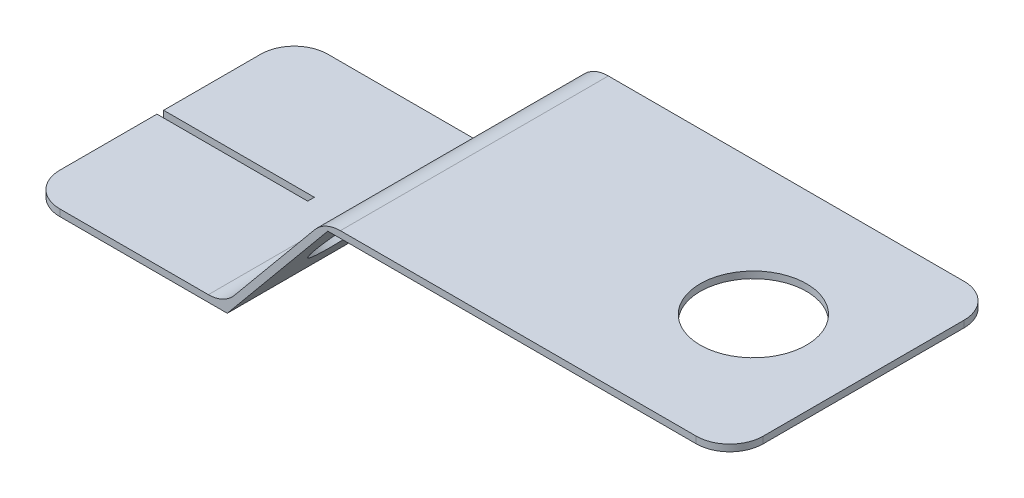
ISO-10303-21;
HEADER;
FILE_DESCRIPTION(('STEP AP214'),'2;1');
FILE_NAME('part.step','',(''),(''),'','','');
FILE_SCHEMA(('AUTOMOTIVE_DESIGN { 1 0 10303 214 1 1 1 1 }'));
ENDSEC;
DATA;
#1=APPLICATION_CONTEXT('core data for automotive mechanical design processes');
#2=APPLICATION_PROTOCOL_DEFINITION('international standard','automotive_design',2000,#1);
#3=PRODUCT_CONTEXT('',#1,'mechanical');
#4=PRODUCT('Part','Part','',(#3));
#5=PRODUCT_RELATED_PRODUCT_CATEGORY('part','',(#4));
#6=PRODUCT_DEFINITION_FORMATION('','',#4);
#7=PRODUCT_DEFINITION_CONTEXT('part definition',#1,'design');
#8=PRODUCT_DEFINITION('design','',#6,#7);
#9=PRODUCT_DEFINITION_SHAPE('','',#8);
#10=(LENGTH_UNIT() NAMED_UNIT(*) SI_UNIT(.MILLI.,.METRE.));
#11=(NAMED_UNIT(*) PLANE_ANGLE_UNIT() SI_UNIT($,.RADIAN.));
#12=(NAMED_UNIT(*) SI_UNIT($,.STERADIAN.) SOLID_ANGLE_UNIT());
#13=UNCERTAINTY_MEASURE_WITH_UNIT(LENGTH_MEASURE(1.E-05),#10,'distance_accuracy_value','');
#14=(GEOMETRIC_REPRESENTATION_CONTEXT(3) GLOBAL_UNCERTAINTY_ASSIGNED_CONTEXT((#13)) GLOBAL_UNIT_ASSIGNED_CONTEXT((#10,
#11,#12)) REPRESENTATION_CONTEXT('',''));
#15=CARTESIAN_POINT('',(0.,0.,0.));
#16=DIRECTION('',(0.,0.,1.));
#17=DIRECTION('',(1.,0.,0.));
#18=AXIS2_PLACEMENT_3D('',#15,#16,#17);
#19=CARTESIAN_POINT('',(0.,0.2,4.));
#20=DIRECTION('',(1.,0.,0.));
#21=DIRECTION('',(0.,0.,-1.));
#22=AXIS2_PLACEMENT_3D('',#19,#20,#21);
#23=PLANE('',#22);
#24=DIRECTION('',(0.,0.,-1.));
#25=VECTOR('',#24,1.);
#26=CARTESIAN_POINT('',(0.,0.,4.));
#27=LINE('',#26,#25);
#28=CARTESIAN_POINT('',(0.,0.,-0.1));
#29=VERTEX_POINT('',#28);
#30=CARTESIAN_POINT('',(0.,0.,-3.));
#31=VERTEX_POINT('',#30);
#32=EDGE_CURVE('E289',#29,#31,#27,.T.);
#33=ORIENTED_EDGE('',*,*,#32,.F.);
#34=DIRECTION('',(0.,1.,0.));
#35=VECTOR('',#34,1.);
#36=CARTESIAN_POINT('',(0.,-9.8,-0.1));
#37=LINE('',#36,#35);
#38=CARTESIAN_POINT('',(0.,0.2,-0.1));
#39=VERTEX_POINT('',#38);
#40=EDGE_CURVE('E204',#29,#39,#37,.T.);
#41=ORIENTED_EDGE('',*,*,#40,.T.);
#42=DIRECTION('',(0.,0.,-1.));
#43=VECTOR('',#42,1.);
#44=CARTESIAN_POINT('',(0.,0.2,4.));
#45=LINE('',#44,#43);
#46=CARTESIAN_POINT('',(0.,0.2,-3.));
#47=VERTEX_POINT('',#46);
#48=EDGE_CURVE('E251',#39,#47,#45,.T.);
#49=ORIENTED_EDGE('',*,*,#48,.T.);
#50=DIRECTION('',(0.,-1.,0.));
#51=VECTOR('',#50,1.);
#52=CARTESIAN_POINT('',(0.,0.2,-3.));
#53=LINE('',#52,#51);
#54=EDGE_CURVE('E331',#47,#31,#53,.T.);
#55=ORIENTED_EDGE('',*,*,#54,.T.);
#56=EDGE_LOOP('',(#33,#41,#49,#55));
#57=FACE_BOUND('',#56,.T.);
#58=ADVANCED_FACE('F42',(#57),#23,.F.);
#59=CARTESIAN_POINT('',(0.,0.2,3.));
#60=VERTEX_POINT('',#59);
#61=CARTESIAN_POINT('',(0.,0.2,0.1));
#62=VERTEX_POINT('',#61);
#63=EDGE_CURVE('E270',#60,#62,#45,.T.);
#64=ORIENTED_EDGE('',*,*,#63,.T.);
#65=DIRECTION('',(0.,1.,0.));
#66=VECTOR('',#65,1.);
#67=CARTESIAN_POINT('',(0.,-9.8,0.1));
#68=LINE('',#67,#66);
#69=CARTESIAN_POINT('',(0.,0.,0.1));
#70=VERTEX_POINT('',#69);
#71=EDGE_CURVE('E182',#70,#62,#68,.T.);
#72=ORIENTED_EDGE('',*,*,#71,.F.);
#73=CARTESIAN_POINT('',(0.,0.,3.));
#74=VERTEX_POINT('',#73);
#75=EDGE_CURVE('E290',#74,#70,#27,.T.);
#76=ORIENTED_EDGE('',*,*,#75,.F.);
#77=DIRECTION('',(0.,-1.,0.));
#78=VECTOR('',#77,1.);
#79=CARTESIAN_POINT('',(0.,0.2,3.));
#80=LINE('',#79,#78);
#81=EDGE_CURVE('E328',#74,#60,#80,.F.);
#82=ORIENTED_EDGE('',*,*,#81,.T.);
#83=EDGE_LOOP('',(#64,#72,#76,#82));
#84=FACE_BOUND('',#83,.T.);
#85=ADVANCED_FACE('F426',(#84),#23,.F.);
#86=CARTESIAN_POINT('',(0.,0.,4.));
#87=DIRECTION('',(0.,1.,0.));
#88=DIRECTION('',(0.,0.,1.));
#89=AXIS2_PLACEMENT_3D('',#86,#87,#88);
#90=PLANE('',#89);
#91=DIRECTION('',(0.,0.,-1.));
#92=VECTOR('',#91,1.);
#93=CARTESIAN_POINT('',(4.5,0.,4.));
#94=LINE('',#93,#92);
#95=CARTESIAN_POINT('',(4.5,0.,0.0999999999999999));
#96=VERTEX_POINT('',#95);
#97=CARTESIAN_POINT('',(4.5,0.,-0.1));
#98=VERTEX_POINT('',#97);
#99=EDGE_CURVE('E177',#96,#98,#94,.T.);
#100=ORIENTED_EDGE('',*,*,#99,.T.);
#101=DIRECTION('',(-1.,0.,0.));
#102=VECTOR('',#101,1.);
#103=CARTESIAN_POINT('',(0.,0.,-0.1));
#104=LINE('',#103,#102);
#105=EDGE_CURVE('E217',#98,#29,#104,.T.);
#106=ORIENTED_EDGE('',*,*,#105,.T.);
#107=ORIENTED_EDGE('',*,*,#32,.T.);
#108=CARTESIAN_POINT('',(1.,0.,-3.));
#109=DIRECTION('',(0.,1.,0.));
#110=DIRECTION('',(0.,0.,1.));
#111=AXIS2_PLACEMENT_3D('',#108,#109,#110);
#112=CIRCLE('',#111,1.);
#113=CARTESIAN_POINT('',(1.,0.,-4.));
#114=VERTEX_POINT('',#113);
#115=EDGE_CURVE('E338',#31,#114,#112,.F.);
#116=ORIENTED_EDGE('',*,*,#115,.T.);
#117=DIRECTION('',(1.,0.,0.));
#118=VECTOR('',#117,1.);
#119=CARTESIAN_POINT('',(0.,0.,-4.));
#120=LINE('',#119,#118);
#121=CARTESIAN_POINT('',(6.,0.,-4.));
#122=VERTEX_POINT('',#121);
#123=EDGE_CURVE('E229',#114,#122,#120,.T.);
#124=ORIENTED_EDGE('',*,*,#123,.T.);
#125=DIRECTION('',(0.,0.,-1.));
#126=VECTOR('',#125,1.);
#127=CARTESIAN_POINT('',(6.,0.,4.));
#128=LINE('',#127,#126);
#129=CARTESIAN_POINT('',(6.,0.,4.));
#130=VERTEX_POINT('',#129);
#131=EDGE_CURVE('E285',#130,#122,#128,.T.);
#132=ORIENTED_EDGE('',*,*,#131,.F.);
#133=DIRECTION('',(1.,0.,0.));
#134=VECTOR('',#133,1.);
#135=CARTESIAN_POINT('',(0.,0.,4.));
#136=LINE('',#135,#134);
#137=CARTESIAN_POINT('',(1.,0.,4.));
#138=VERTEX_POINT('',#137);
#139=EDGE_CURVE('E230',#138,#130,#136,.T.);
#140=ORIENTED_EDGE('',*,*,#139,.F.);
#141=CARTESIAN_POINT('',(1.,0.,3.));
#142=DIRECTION('',(0.,1.,0.));
#143=DIRECTION('',(0.,0.,1.));
#144=AXIS2_PLACEMENT_3D('',#141,#142,#143);
#145=CIRCLE('',#144,1.);
#146=EDGE_CURVE('E335',#138,#74,#145,.F.);
#147=ORIENTED_EDGE('',*,*,#146,.T.);
#148=ORIENTED_EDGE('',*,*,#75,.T.);
#149=DIRECTION('',(1.,0.,0.));
#150=VECTOR('',#149,1.);
#151=CARTESIAN_POINT('',(0.,0.,0.1));
#152=LINE('',#151,#150);
#153=EDGE_CURVE('E208',#70,#96,#152,.T.);
#154=ORIENTED_EDGE('',*,*,#153,.T.);
#155=EDGE_LOOP('',(#100,#106,#107,#116,#124,#132,#140,#147,#148,#154));
#156=FACE_BOUND('',#155,.T.);
#157=ADVANCED_FACE('F388',(#156),#90,.F.);
#158=CARTESIAN_POINT('',(6.,0.,4.));
#159=DIRECTION('',(-0.77039432112469,0.637567714034226,0.));
#160=DIRECTION('',(-0.637567714034226,-0.77039432112469,0.));
#161=AXIS2_PLACEMENT_3D('',#158,#159,#160);
#162=PLANE('',#161);
#163=CARTESIAN_POINT('',(7.55998879215985,1.88498645719316,1.75));
#164=DIRECTION('',(-0.77039432112469,0.637567714034226,0.));
#165=DIRECTION('',(-0.637567714034226,-0.77039432112469,0.));
#166=AXIS2_PLACEMENT_3D('',#163,#164,#165);
#167=CIRCLE('',#166,1.190625);
#168=CARTESIAN_POINT('',(6.80088473263785,0.967735718604073,1.75));
#169=VERTEX_POINT('',#168);
#170=EDGE_CURVE('E584',#169,#169,#167,.F.);
#171=ORIENTED_EDGE('',*,*,#170,.F.);
#172=EDGE_LOOP('',(#171));
#173=FACE_BOUND('',#172,.T.);
#174=CARTESIAN_POINT('',(7.55998879215985,1.88498645719316,-1.75));
#175=DIRECTION('',(-0.77039432112469,0.637567714034226,0.));
#176=DIRECTION('',(-0.637567714034226,-0.77039432112469,0.));
#177=AXIS2_PLACEMENT_3D('',#174,#175,#176);
#178=CIRCLE('',#177,1.190625);
#179=CARTESIAN_POINT('',(6.80088473263785,0.967735718604073,-1.75));
#180=VERTEX_POINT('',#179);
#181=EDGE_CURVE('E192',#180,#180,#178,.T.);
#182=ORIENTED_EDGE('',*,*,#181,.T.);
#183=EDGE_LOOP('',(#182));
#184=FACE_BOUND('',#183,.T.);
#185=DIRECTION('',(0.637567714034226,0.77039432112469,0.));
#186=VECTOR('',#185,1.);
#187=CARTESIAN_POINT('',(6.,0.,-4.));
#188=LINE('',#187,#186);
#189=CARTESIAN_POINT('',(9.,3.625,-4.));
#190=VERTEX_POINT('',#189);
#191=EDGE_CURVE('E254',#122,#190,#188,.T.);
#192=ORIENTED_EDGE('',*,*,#191,.T.);
#193=DIRECTION('',(0.,0.,-1.));
#194=VECTOR('',#193,1.);
#195=CARTESIAN_POINT('',(9.,3.625,4.));
#196=LINE('',#195,#194);
#197=CARTESIAN_POINT('',(9.,3.625,4.));
#198=VERTEX_POINT('',#197);
#199=EDGE_CURVE('E281',#198,#190,#196,.T.);
#200=ORIENTED_EDGE('',*,*,#199,.F.);
#201=DIRECTION('',(0.637567714034226,0.77039432112469,0.));
#202=VECTOR('',#201,1.);
#203=CARTESIAN_POINT('',(6.,0.,4.));
#204=LINE('',#203,#202);
#205=EDGE_CURVE('E233',#130,#198,#204,.T.);
#206=ORIENTED_EDGE('',*,*,#205,.F.);
#207=ORIENTED_EDGE('',*,*,#131,.T.);
#208=EDGE_LOOP('',(#192,#200,#206,#207));
#209=FACE_BOUND('',#208,.T.);
#210=ADVANCED_FACE('F395',(#173,#184,#209),#162,.F.);
#211=CARTESIAN_POINT('',(9.,3.625,4.));
#212=DIRECTION('',(0.,1.,0.));
#213=DIRECTION('',(-1.,0.,0.));
#214=AXIS2_PLACEMENT_3D('',#211,#212,#213);
#215=PLANE('',#214);
#216=CARTESIAN_POINT('',(17.7059099279349,3.625,0.));
#217=DIRECTION('',(0.,1.,0.));
#218=DIRECTION('',(-1.,0.,0.));
#219=AXIS2_PLACEMENT_3D('',#216,#217,#218);
#220=CIRCLE('',#219,1.5875);
#221=CARTESIAN_POINT('',(16.1184099279349,3.625,0.));
#222=VERTEX_POINT('',#221);
#223=EDGE_CURVE('E225',#222,#222,#220,.T.);
#224=ORIENTED_EDGE('',*,*,#223,.T.);
#225=EDGE_LOOP('',(#224));
#226=FACE_BOUND('',#225,.T.);
#227=DIRECTION('',(1.,0.,0.));
#228=VECTOR('',#227,1.);
#229=CARTESIAN_POINT('',(9.,3.625,-4.));
#230=LINE('',#229,#228);
#231=CARTESIAN_POINT('',(20.,3.625,-4.));
#232=VERTEX_POINT('',#231);
#233=EDGE_CURVE('E257',#190,#232,#230,.T.);
#234=ORIENTED_EDGE('',*,*,#233,.T.);
#235=CARTESIAN_POINT('',(20.,3.625,-3.));
#236=DIRECTION('',(0.,1.,0.));
#237=DIRECTION('',(-1.,0.,0.));
#238=AXIS2_PLACEMENT_3D('',#235,#236,#237);
#239=CIRCLE('',#238,1.);
#240=CARTESIAN_POINT('',(21.,3.625,-3.));
#241=VERTEX_POINT('',#240);
#242=EDGE_CURVE('E317',#232,#241,#239,.F.);
#243=ORIENTED_EDGE('',*,*,#242,.T.);
#244=DIRECTION('',(0.,0.,-1.));
#245=VECTOR('',#244,1.);
#246=CARTESIAN_POINT('',(21.,3.625,4.));
#247=LINE('',#246,#245);
#248=CARTESIAN_POINT('',(21.,3.625,3.));
#249=VERTEX_POINT('',#248);
#250=EDGE_CURVE('E277',#249,#241,#247,.T.);
#251=ORIENTED_EDGE('',*,*,#250,.F.);
#252=CARTESIAN_POINT('',(20.,3.625,3.));
#253=DIRECTION('',(0.,1.,0.));
#254=DIRECTION('',(-1.,0.,0.));
#255=AXIS2_PLACEMENT_3D('',#252,#253,#254);
#256=CIRCLE('',#255,1.);
#257=CARTESIAN_POINT('',(20.,3.625,4.));
#258=VERTEX_POINT('',#257);
#259=EDGE_CURVE('E314',#249,#258,#256,.F.);
#260=ORIENTED_EDGE('',*,*,#259,.T.);
#261=DIRECTION('',(1.,0.,0.));
#262=VECTOR('',#261,1.);
#263=CARTESIAN_POINT('',(9.,3.625,4.));
#264=LINE('',#263,#262);
#265=EDGE_CURVE('E237',#198,#258,#264,.T.);
#266=ORIENTED_EDGE('',*,*,#265,.F.);
#267=ORIENTED_EDGE('',*,*,#199,.T.);
#268=EDGE_LOOP('',(#234,#243,#251,#260,#266,#267));
#269=FACE_BOUND('',#268,.T.);
#270=ADVANCED_FACE('F414',(#226,#269),#215,.F.);
#271=CARTESIAN_POINT('',(21.,3.825,4.));
#272=DIRECTION('',(-1.,0.,0.));
#273=DIRECTION('',(0.,0.,1.));
#274=AXIS2_PLACEMENT_3D('',#271,#272,#273);
#275=PLANE('',#274);
#276=ORIENTED_EDGE('',*,*,#250,.T.);
#277=DIRECTION('',(0.,1.,0.));
#278=VECTOR('',#277,1.);
#279=CARTESIAN_POINT('',(21.,3.825,-3.));
#280=LINE('',#279,#278);
#281=CARTESIAN_POINT('',(21.,3.825,-3.));
#282=VERTEX_POINT('',#281);
#283=EDGE_CURVE('E297',#241,#282,#280,.T.);
#284=ORIENTED_EDGE('',*,*,#283,.T.);
#285=DIRECTION('',(0.,0.,-1.));
#286=VECTOR('',#285,1.);
#287=CARTESIAN_POINT('',(21.,3.825,4.));
#288=LINE('',#287,#286);
#289=CARTESIAN_POINT('',(21.,3.825,3.));
#290=VERTEX_POINT('',#289);
#291=EDGE_CURVE('E273',#290,#282,#288,.T.);
#292=ORIENTED_EDGE('',*,*,#291,.F.);
#293=DIRECTION('',(0.,1.,0.));
#294=VECTOR('',#293,1.);
#295=CARTESIAN_POINT('',(21.,3.625,3.));
#296=LINE('',#295,#294);
#297=EDGE_CURVE('E294',#290,#249,#296,.F.);
#298=ORIENTED_EDGE('',*,*,#297,.T.);
#299=EDGE_LOOP('',(#276,#284,#292,#298));
#300=FACE_BOUND('',#299,.T.);
#301=ADVANCED_FACE('F406',(#300),#275,.F.);
#302=CARTESIAN_POINT('',(8.90590992793492,3.825,4.));
#303=DIRECTION('',(0.,-1.,0.));
#304=DIRECTION('',(0.,0.,-1.));
#305=AXIS2_PLACEMENT_3D('',#302,#303,#304);
#306=PLANE('',#305);
#307=CARTESIAN_POINT('',(17.7059099279349,3.825,0.));
#308=DIRECTION('',(0.,1.,0.));
#309=DIRECTION('',(0.,0.,1.));
#310=AXIS2_PLACEMENT_3D('',#307,#308,#309);
#311=CIRCLE('',#310,1.5875);
#312=CARTESIAN_POINT('',(17.7059099279349,3.825,1.5875));
#313=VERTEX_POINT('',#312);
#314=EDGE_CURVE('E221',#313,#313,#311,.T.);
#315=ORIENTED_EDGE('',*,*,#314,.F.);
#316=EDGE_LOOP('',(#315));
#317=FACE_BOUND('',#316,.T.);
#318=DIRECTION('',(-1.,0.,0.));
#319=VECTOR('',#318,1.);
#320=CARTESIAN_POINT('',(8.90590992793492,3.825,-4.));
#321=LINE('',#320,#319);
#322=CARTESIAN_POINT('',(20.,3.825,-4.));
#323=VERTEX_POINT('',#322);
#324=CARTESIAN_POINT('',(9.37636028826035,3.825,-4.));
#325=VERTEX_POINT('',#324);
#326=EDGE_CURVE('E261',#323,#325,#321,.T.);
#327=ORIENTED_EDGE('',*,*,#326,.T.);
#328=DIRECTION('',(0.,0.,-1.));
#329=VECTOR('',#328,1.);
#330=CARTESIAN_POINT('',(9.37636028826035,3.825,4.));
#331=LINE('',#330,#329);
#332=CARTESIAN_POINT('',(9.37636028826035,3.825,4.));
#333=VERTEX_POINT('',#332);
#334=EDGE_CURVE('E58',#325,#333,#331,.F.);
#335=ORIENTED_EDGE('',*,*,#334,.T.);
#336=DIRECTION('',(-1.,0.,0.));
#337=VECTOR('',#336,1.);
#338=CARTESIAN_POINT('',(8.90590992793492,3.825,4.));
#339=LINE('',#338,#337);
#340=CARTESIAN_POINT('',(20.,3.825,4.));
#341=VERTEX_POINT('',#340);
#342=EDGE_CURVE('E241',#341,#333,#339,.T.);
#343=ORIENTED_EDGE('',*,*,#342,.F.);
#344=CARTESIAN_POINT('',(20.,3.825,3.));
#345=DIRECTION('',(0.,-1.,0.));
#346=DIRECTION('',(0.,0.,-1.));
#347=AXIS2_PLACEMENT_3D('',#344,#345,#346);
#348=CIRCLE('',#347,1.);
#349=EDGE_CURVE('E301',#341,#290,#348,.F.);
#350=ORIENTED_EDGE('',*,*,#349,.T.);
#351=ORIENTED_EDGE('',*,*,#291,.T.);
#352=CARTESIAN_POINT('',(20.,3.825,-3.));
#353=DIRECTION('',(0.,-1.,0.));
#354=DIRECTION('',(0.,0.,-1.));
#355=AXIS2_PLACEMENT_3D('',#352,#353,#354);
#356=CIRCLE('',#355,1.);
#357=EDGE_CURVE('E304',#282,#323,#356,.F.);
#358=ORIENTED_EDGE('',*,*,#357,.T.);
#359=EDGE_LOOP('',(#327,#335,#343,#350,#351,#358));
#360=FACE_BOUND('',#359,.T.);
#361=ADVANCED_FACE('F404',(#317,#360),#306,.F.);
#362=CARTESIAN_POINT('',(5.90590992793492,0.2,4.));
#363=DIRECTION('',(0.770394321124689,-0.637567714034226,0.));
#364=DIRECTION('',(0.637567714034226,0.770394321124689,0.));
#365=AXIS2_PLACEMENT_3D('',#362,#363,#364);
#366=PLANE('',#365);
#367=CARTESIAN_POINT('',(7.40590992793492,2.0125,1.75));
#368=DIRECTION('',(0.77039432112469,-0.637567714034226,0.));
#369=DIRECTION('',(-0.637567714034226,-0.77039432112469,0.));
#370=AXIS2_PLACEMENT_3D('',#367,#368,#369);
#371=CIRCLE('',#370,1.190625);
#372=CARTESIAN_POINT('',(6.64680586841292,1.09524926141092,1.75));
#373=VERTEX_POINT('',#372);
#374=EDGE_CURVE('E581',#373,#373,#371,.T.);
#375=ORIENTED_EDGE('',*,*,#374,.T.);
#376=EDGE_LOOP('',(#375));
#377=FACE_BOUND('',#376,.T.);
#378=CARTESIAN_POINT('',(7.40590992793492,2.0125,-1.75));
#379=DIRECTION('',(-0.77039432112469,0.637567714034226,0.));
#380=DIRECTION('',(-0.637567714034226,-0.77039432112469,0.));
#381=AXIS2_PLACEMENT_3D('',#378,#379,#380);
#382=CIRCLE('',#381,1.190625);
#383=CARTESIAN_POINT('',(6.64680586841292,1.09524926141092,-1.75));
#384=VERTEX_POINT('',#383);
#385=EDGE_CURVE('E586',#384,#384,#382,.T.);
#386=ORIENTED_EDGE('',*,*,#385,.F.);
#387=EDGE_LOOP('',(#386));
#388=FACE_BOUND('',#387,.T.);
#389=DIRECTION('',(-0.637567714034226,-0.770394321124689,0.));
#390=VECTOR('',#389,1.);
#391=CARTESIAN_POINT('',(5.90590992793492,0.2,-4.));
#392=LINE('',#391,#390);
#393=CARTESIAN_POINT('',(8.60596596713566,3.46256771403423,-4.));
#394=VERTEX_POINT('',#393);
#395=CARTESIAN_POINT('',(6.20585388873418,0.562432285965774,-4.));
#396=VERTEX_POINT('',#395);
#397=EDGE_CURVE('E264',#394,#396,#392,.T.);
#398=ORIENTED_EDGE('',*,*,#397,.T.);
#399=DIRECTION('',(0.,0.,-1.));
#400=VECTOR('',#399,1.);
#401=CARTESIAN_POINT('',(6.20585388873418,0.562432285965774,4.));
#402=LINE('',#401,#400);
#403=CARTESIAN_POINT('',(6.20585388873418,0.562432285965774,4.));
#404=VERTEX_POINT('',#403);
#405=EDGE_CURVE('E357',#396,#404,#402,.F.);
#406=ORIENTED_EDGE('',*,*,#405,.T.);
#407=DIRECTION('',(-0.637567714034226,-0.770394321124689,0.));
#408=VECTOR('',#407,1.);
#409=CARTESIAN_POINT('',(5.90590992793492,0.2,4.));
#410=LINE('',#409,#408);
#411=CARTESIAN_POINT('',(8.60596596713566,3.46256771403423,4.));
#412=VERTEX_POINT('',#411);
#413=EDGE_CURVE('E244',#412,#404,#410,.T.);
#414=ORIENTED_EDGE('',*,*,#413,.F.);
#415=DIRECTION('',(0.,0.,-1.));
#416=VECTOR('',#415,1.);
#417=CARTESIAN_POINT('',(8.60596596713566,3.46256771403423,4.));
#418=LINE('',#417,#416);
#419=EDGE_CURVE('E353',#412,#394,#418,.T.);
#420=ORIENTED_EDGE('',*,*,#419,.T.);
#421=EDGE_LOOP('',(#398,#406,#414,#420));
#422=FACE_BOUND('',#421,.T.);
#423=ADVANCED_FACE('F373',(#377,#388,#422),#366,.F.);
#424=CARTESIAN_POINT('',(0.,0.2,4.));
#425=DIRECTION('',(0.,-1.,0.));
#426=DIRECTION('',(1.,0.,0.));
#427=AXIS2_PLACEMENT_3D('',#424,#425,#426);
#428=PLANE('',#427);
#429=DIRECTION('',(-1.,0.,0.));
#430=VECTOR('',#429,1.);
#431=CARTESIAN_POINT('',(0.,0.2,4.));
#432=LINE('',#431,#430);
#433=CARTESIAN_POINT('',(5.43545956760949,0.2,4.));
#434=VERTEX_POINT('',#433);
#435=CARTESIAN_POINT('',(1.,0.2,4.));
#436=VERTEX_POINT('',#435);
#437=EDGE_CURVE('E248',#434,#436,#432,.T.);
#438=ORIENTED_EDGE('',*,*,#437,.F.);
#439=DIRECTION('',(0.,0.,-1.));
#440=VECTOR('',#439,1.);
#441=CARTESIAN_POINT('',(5.43545956760949,0.2,-4.));
#442=LINE('',#441,#440);
#443=CARTESIAN_POINT('',(5.43545956760949,0.2,-4.));
#444=VERTEX_POINT('',#443);
#445=EDGE_CURVE('E349',#434,#444,#442,.T.);
#446=ORIENTED_EDGE('',*,*,#445,.T.);
#447=DIRECTION('',(-1.,0.,0.));
#448=VECTOR('',#447,1.);
#449=CARTESIAN_POINT('',(0.,0.2,-4.));
#450=LINE('',#449,#448);
#451=CARTESIAN_POINT('',(1.,0.2,-4.));
#452=VERTEX_POINT('',#451);
#453=EDGE_CURVE('E234',#444,#452,#450,.T.);
#454=ORIENTED_EDGE('',*,*,#453,.T.);
#455=CARTESIAN_POINT('',(1.,0.2,-3.));
#456=DIRECTION('',(0.,-1.,0.));
#457=DIRECTION('',(1.,0.,0.));
#458=AXIS2_PLACEMENT_3D('',#455,#456,#457);
#459=CIRCLE('',#458,1.);
#460=EDGE_CURVE('E345',#452,#47,#459,.F.);
#461=ORIENTED_EDGE('',*,*,#460,.T.);
#462=ORIENTED_EDGE('',*,*,#48,.F.);
#463=DIRECTION('',(-1.,0.,0.));
#464=VECTOR('',#463,1.);
#465=CARTESIAN_POINT('',(0.,0.2,-0.1));
#466=LINE('',#465,#464);
#467=CARTESIAN_POINT('',(4.5,0.2,-0.1));
#468=VERTEX_POINT('',#467);
#469=EDGE_CURVE('E197',#468,#39,#466,.T.);
#470=ORIENTED_EDGE('',*,*,#469,.F.);
#471=DIRECTION('',(0.,0.,-1.));
#472=VECTOR('',#471,1.);
#473=CARTESIAN_POINT('',(4.5,0.2,-0.1));
#474=LINE('',#473,#472);
#475=CARTESIAN_POINT('',(4.5,0.2,0.0999999999999999));
#476=VERTEX_POINT('',#475);
#477=EDGE_CURVE('E174',#476,#468,#474,.T.);
#478=ORIENTED_EDGE('',*,*,#477,.F.);
#479=DIRECTION('',(1.,0.,0.));
#480=VECTOR('',#479,1.);
#481=CARTESIAN_POINT('',(0.,0.2,0.1));
#482=LINE('',#481,#480);
#483=EDGE_CURVE('E185',#62,#476,#482,.T.);
#484=ORIENTED_EDGE('',*,*,#483,.F.);
#485=ORIENTED_EDGE('',*,*,#63,.F.);
#486=CARTESIAN_POINT('',(1.,0.2,3.));
#487=DIRECTION('',(0.,-1.,0.));
#488=DIRECTION('',(1.,0.,0.));
#489=AXIS2_PLACEMENT_3D('',#486,#487,#488);
#490=CIRCLE('',#489,1.);
#491=EDGE_CURVE('E341',#60,#436,#490,.F.);
#492=ORIENTED_EDGE('',*,*,#491,.T.);
#493=EDGE_LOOP('',(#438,#446,#454,#461,#462,#470,#478,#484,#485,#492));
#494=FACE_BOUND('',#493,.T.);
#495=ADVANCED_FACE('F195',(#494),#428,.F.);
#496=CARTESIAN_POINT('',(0.,0.,4.));
#497=DIRECTION('',(0.,0.,1.));
#498=DIRECTION('',(1.,0.,0.));
#499=AXIS2_PLACEMENT_3D('',#496,#497,#498);
#500=PLANE('',#499);
#501=ORIENTED_EDGE('',*,*,#342,.T.);
#502=CARTESIAN_POINT('',(9.37636028826035,2.825,4.));
#503=DIRECTION('',(0.,0.,1.));
#504=DIRECTION('',(1.,0.,0.));
#505=AXIS2_PLACEMENT_3D('',#502,#503,#504);
#506=CIRCLE('',#505,1.);
#507=EDGE_CURVE('E364',#333,#412,#506,.T.);
#508=ORIENTED_EDGE('',*,*,#507,.T.);
#509=ORIENTED_EDGE('',*,*,#413,.T.);
#510=CARTESIAN_POINT('',(5.43545956760949,1.2,4.));
#511=DIRECTION('',(0.,0.,1.));
#512=DIRECTION('',(1.,0.,0.));
#513=AXIS2_PLACEMENT_3D('',#510,#511,#512);
#514=CIRCLE('',#513,1.);
#515=EDGE_CURVE('E11',#404,#434,#514,.F.);
#516=ORIENTED_EDGE('',*,*,#515,.T.);
#517=ORIENTED_EDGE('',*,*,#437,.T.);
#518=DIRECTION('',(0.,-1.,0.));
#519=VECTOR('',#518,1.);
#520=CARTESIAN_POINT('',(1.,0.,4.));
#521=LINE('',#520,#519);
#522=EDGE_CURVE('E320',#436,#138,#521,.T.);
#523=ORIENTED_EDGE('',*,*,#522,.T.);
#524=ORIENTED_EDGE('',*,*,#139,.T.);
#525=ORIENTED_EDGE('',*,*,#205,.T.);
#526=ORIENTED_EDGE('',*,*,#265,.T.);
#527=DIRECTION('',(0.,1.,0.));
#528=VECTOR('',#527,1.);
#529=CARTESIAN_POINT('',(20.,3.825,4.));
#530=LINE('',#529,#528);
#531=EDGE_CURVE('E324',#258,#341,#530,.T.);
#532=ORIENTED_EDGE('',*,*,#531,.T.);
#533=EDGE_LOOP('',(#501,#508,#509,#516,#517,#523,#524,#525,#526,#532));
#534=FACE_BOUND('',#533,.T.);
#535=ADVANCED_FACE('F379',(#534),#500,.T.);
#536=CARTESIAN_POINT('',(0.,0.,-4.));
#537=DIRECTION('',(0.,0.,1.));
#538=DIRECTION('',(1.,0.,0.));
#539=AXIS2_PLACEMENT_3D('',#536,#537,#538);
#540=PLANE('',#539);
#541=ORIENTED_EDGE('',*,*,#397,.F.);
#542=CARTESIAN_POINT('',(9.37636028826035,2.825,-4.));
#543=DIRECTION('',(0.,0.,1.));
#544=DIRECTION('',(1.,0.,0.));
#545=AXIS2_PLACEMENT_3D('',#542,#543,#544);
#546=CIRCLE('',#545,1.);
#547=EDGE_CURVE('E66',#394,#325,#546,.F.);
#548=ORIENTED_EDGE('',*,*,#547,.T.);
#549=ORIENTED_EDGE('',*,*,#326,.F.);
#550=DIRECTION('',(0.,1.,0.));
#551=VECTOR('',#550,1.);
#552=CARTESIAN_POINT('',(20.,0.,-4.));
#553=LINE('',#552,#551);
#554=EDGE_CURVE('E311',#323,#232,#553,.F.);
#555=ORIENTED_EDGE('',*,*,#554,.T.);
#556=ORIENTED_EDGE('',*,*,#233,.F.);
#557=ORIENTED_EDGE('',*,*,#191,.F.);
#558=ORIENTED_EDGE('',*,*,#123,.F.);
#559=DIRECTION('',(0.,-1.,0.));
#560=VECTOR('',#559,1.);
#561=CARTESIAN_POINT('',(1.,0.,-4.));
#562=LINE('',#561,#560);
#563=EDGE_CURVE('E307',#114,#452,#562,.F.);
#564=ORIENTED_EDGE('',*,*,#563,.T.);
#565=ORIENTED_EDGE('',*,*,#453,.F.);
#566=CARTESIAN_POINT('',(5.43545956760949,1.2,-4.));
#567=DIRECTION('',(0.,0.,1.));
#568=DIRECTION('',(1.,0.,0.));
#569=AXIS2_PLACEMENT_3D('',#566,#567,#568);
#570=CIRCLE('',#569,1.);
#571=EDGE_CURVE('E51',#444,#396,#570,.T.);
#572=ORIENTED_EDGE('',*,*,#571,.T.);
#573=EDGE_LOOP('',(#541,#548,#549,#555,#556,#557,#558,#564,#565,#572));
#574=FACE_BOUND('',#573,.T.);
#575=ADVANCED_FACE('F368',(#574),#540,.F.);
#576=CARTESIAN_POINT('',(17.7059099279349,-6.175,0.));
#577=DIRECTION('',(0.,1.,0.));
#578=DIRECTION('',(0.,0.,1.));
#579=AXIS2_PLACEMENT_3D('',#576,#577,#578);
#580=CYLINDRICAL_SURFACE('',#579,1.5875);
#581=ORIENTED_EDGE('',*,*,#314,.T.);
#582=EDGE_LOOP('',(#581));
#583=FACE_BOUND('',#582,.T.);
#584=ORIENTED_EDGE('',*,*,#223,.F.);
#585=EDGE_LOOP('',(#584));
#586=FACE_BOUND('',#585,.T.);
#587=ADVANCED_FACE('F438',(#583,#586),#580,.F.);
#588=CARTESIAN_POINT('',(20.,3.825,-3.));
#589=DIRECTION('',(0.,1.,0.));
#590=DIRECTION('',(0.,0.,1.));
#591=AXIS2_PLACEMENT_3D('',#588,#589,#590);
#592=CYLINDRICAL_SURFACE('',#591,1.);
#593=ORIENTED_EDGE('',*,*,#242,.F.);
#594=ORIENTED_EDGE('',*,*,#554,.F.);
#595=ORIENTED_EDGE('',*,*,#357,.F.);
#596=ORIENTED_EDGE('',*,*,#283,.F.);
#597=EDGE_LOOP('',(#593,#594,#595,#596));
#598=FACE_BOUND('',#597,.T.);
#599=ADVANCED_FACE('F411',(#598),#592,.T.);
#600=CARTESIAN_POINT('',(20.,0.,3.));
#601=DIRECTION('',(0.,-1.,0.));
#602=DIRECTION('',(0.,0.,-1.));
#603=AXIS2_PLACEMENT_3D('',#600,#601,#602);
#604=CYLINDRICAL_SURFACE('',#603,1.);
#605=ORIENTED_EDGE('',*,*,#259,.F.);
#606=ORIENTED_EDGE('',*,*,#297,.F.);
#607=ORIENTED_EDGE('',*,*,#349,.F.);
#608=ORIENTED_EDGE('',*,*,#531,.F.);
#609=EDGE_LOOP('',(#605,#606,#607,#608));
#610=FACE_BOUND('',#609,.T.);
#611=ADVANCED_FACE('F401',(#610),#604,.T.);
#612=CARTESIAN_POINT('',(1.,0.2,-3.));
#613=DIRECTION('',(0.,-1.,0.));
#614=DIRECTION('',(0.,0.,-1.));
#615=AXIS2_PLACEMENT_3D('',#612,#613,#614);
#616=CYLINDRICAL_SURFACE('',#615,1.);
#617=ORIENTED_EDGE('',*,*,#460,.F.);
#618=ORIENTED_EDGE('',*,*,#563,.F.);
#619=ORIENTED_EDGE('',*,*,#115,.F.);
#620=ORIENTED_EDGE('',*,*,#54,.F.);
#621=EDGE_LOOP('',(#617,#618,#619,#620));
#622=FACE_BOUND('',#621,.T.);
#623=ADVANCED_FACE('F441',(#622),#616,.T.);
#624=CARTESIAN_POINT('',(1.,0.,3.));
#625=DIRECTION('',(0.,1.,0.));
#626=DIRECTION('',(0.,0.,1.));
#627=AXIS2_PLACEMENT_3D('',#624,#625,#626);
#628=CYLINDRICAL_SURFACE('',#627,1.);
#629=ORIENTED_EDGE('',*,*,#491,.F.);
#630=ORIENTED_EDGE('',*,*,#81,.F.);
#631=ORIENTED_EDGE('',*,*,#146,.F.);
#632=ORIENTED_EDGE('',*,*,#522,.F.);
#633=EDGE_LOOP('',(#629,#630,#631,#632));
#634=FACE_BOUND('',#633,.T.);
#635=ADVANCED_FACE('F384',(#634),#628,.T.);
#636=CARTESIAN_POINT('',(0.,-9.8,-0.1));
#637=DIRECTION('',(0.,0.,-1.));
#638=DIRECTION('',(-1.,0.,0.));
#639=AXIS2_PLACEMENT_3D('',#636,#637,#638);
#640=PLANE('',#639);
#641=DIRECTION('',(0.,1.,0.));
#642=VECTOR('',#641,1.);
#643=CARTESIAN_POINT('',(4.5,-9.8,-0.1));
#644=LINE('',#643,#642);
#645=EDGE_CURVE('E181',#98,#468,#644,.T.);
#646=ORIENTED_EDGE('',*,*,#645,.T.);
#647=ORIENTED_EDGE('',*,*,#469,.T.);
#648=ORIENTED_EDGE('',*,*,#40,.F.);
#649=ORIENTED_EDGE('',*,*,#105,.F.);
#650=EDGE_LOOP('',(#646,#647,#648,#649));
#651=FACE_BOUND('',#650,.T.);
#652=ADVANCED_FACE('F446',(#651),#640,.F.);
#653=CARTESIAN_POINT('',(4.5,-9.8,-0.1));
#654=DIRECTION('',(1.,0.,0.));
#655=DIRECTION('',(0.,1.,0.));
#656=AXIS2_PLACEMENT_3D('',#653,#654,#655);
#657=PLANE('',#656);
#658=DIRECTION('',(0.,1.,0.));
#659=VECTOR('',#658,1.);
#660=CARTESIAN_POINT('',(4.5,-9.8,0.0999999999999999));
#661=LINE('',#660,#659);
#662=EDGE_CURVE('E169',#96,#476,#661,.T.);
#663=ORIENTED_EDGE('',*,*,#662,.T.);
#664=ORIENTED_EDGE('',*,*,#477,.T.);
#665=ORIENTED_EDGE('',*,*,#645,.F.);
#666=ORIENTED_EDGE('',*,*,#99,.F.);
#667=EDGE_LOOP('',(#663,#664,#665,#666));
#668=FACE_BOUND('',#667,.T.);
#669=ADVANCED_FACE('F171',(#668),#657,.F.);
#670=CARTESIAN_POINT('',(0.,-9.8,0.1));
#671=DIRECTION('',(0.,0.,1.));
#672=DIRECTION('',(1.,0.,0.));
#673=AXIS2_PLACEMENT_3D('',#670,#671,#672);
#674=PLANE('',#673);
#675=ORIENTED_EDGE('',*,*,#71,.T.);
#676=ORIENTED_EDGE('',*,*,#483,.T.);
#677=ORIENTED_EDGE('',*,*,#662,.F.);
#678=ORIENTED_EDGE('',*,*,#153,.F.);
#679=EDGE_LOOP('',(#675,#676,#677,#678));
#680=FACE_BOUND('',#679,.T.);
#681=ADVANCED_FACE('F186',(#680),#674,.F.);
#682=CARTESIAN_POINT('',(5.43545956760949,1.2,4.));
#683=DIRECTION('',(0.,0.,1.));
#684=DIRECTION('',(1.,0.,0.));
#685=AXIS2_PLACEMENT_3D('',#682,#683,#684);
#686=CYLINDRICAL_SURFACE('',#685,1.);
#687=ORIENTED_EDGE('',*,*,#515,.F.);
#688=ORIENTED_EDGE('',*,*,#405,.F.);
#689=ORIENTED_EDGE('',*,*,#571,.F.);
#690=ORIENTED_EDGE('',*,*,#445,.F.);
#691=EDGE_LOOP('',(#687,#688,#689,#690));
#692=FACE_BOUND('',#691,.T.);
#693=ADVANCED_FACE('F377',(#692),#686,.F.);
#694=CARTESIAN_POINT('',(9.37636028826035,2.825,4.));
#695=DIRECTION('',(0.,0.,-1.));
#696=DIRECTION('',(-1.,0.,0.));
#697=AXIS2_PLACEMENT_3D('',#694,#695,#696);
#698=CYLINDRICAL_SURFACE('',#697,1.);
#699=ORIENTED_EDGE('',*,*,#507,.F.);
#700=ORIENTED_EDGE('',*,*,#334,.F.);
#701=ORIENTED_EDGE('',*,*,#547,.F.);
#702=ORIENTED_EDGE('',*,*,#419,.F.);
#703=EDGE_LOOP('',(#699,#700,#701,#702));
#704=FACE_BOUND('',#703,.T.);
#705=ADVANCED_FACE('F44',(#704),#698,.T.);
#706=CARTESIAN_POINT('',(15.1098531391818,-4.36317714034226,-1.75));
#707=DIRECTION('',(-0.77039432112469,0.637567714034226,0.));
#708=DIRECTION('',(-0.637567714034226,-0.77039432112469,0.));
#709=AXIS2_PLACEMENT_3D('',#706,#707,#708);
#710=CYLINDRICAL_SURFACE('',#709,1.190625);
#711=ORIENTED_EDGE('',*,*,#385,.T.);
#712=EDGE_LOOP('',(#711));
#713=FACE_BOUND('',#712,.T.);
#714=ORIENTED_EDGE('',*,*,#181,.F.);
#715=EDGE_LOOP('',(#714));
#716=FACE_BOUND('',#715,.T.);
#717=ADVANCED_FACE('F452',(#713,#716),#710,.F.);
#718=CARTESIAN_POINT('',(15.1098531391818,-4.36317714034226,1.75));
#719=DIRECTION('',(-0.77039432112469,0.637567714034226,0.));
#720=DIRECTION('',(-0.637567714034226,-0.77039432112469,0.));
#721=AXIS2_PLACEMENT_3D('',#718,#719,#720);
#722=CYLINDRICAL_SURFACE('',#721,1.190625);
#723=ORIENTED_EDGE('',*,*,#374,.F.);
#724=EDGE_LOOP('',(#723));
#725=FACE_BOUND('',#724,.T.);
#726=ORIENTED_EDGE('',*,*,#170,.T.);
#727=EDGE_LOOP('',(#726));
#728=FACE_BOUND('',#727,.T.);
#729=ADVANCED_FACE('F562',(#725,#728),#722,.F.);
#730=CLOSED_SHELL('',(#58,#85,#157,#210,#270,#301,#361,#423,#495,#535,#575,#587,#599,#611,#623,
#635,#652,#669,#681,#693,#705,#717,#729));
#731=MANIFOLD_SOLID_BREP('B2',#730);
#732=ADVANCED_BREP_SHAPE_REPRESENTATION('',(#18,#731),#14);
#733=SHAPE_DEFINITION_REPRESENTATION(#9,#732);
ENDSEC;
END-ISO-10303-21;
